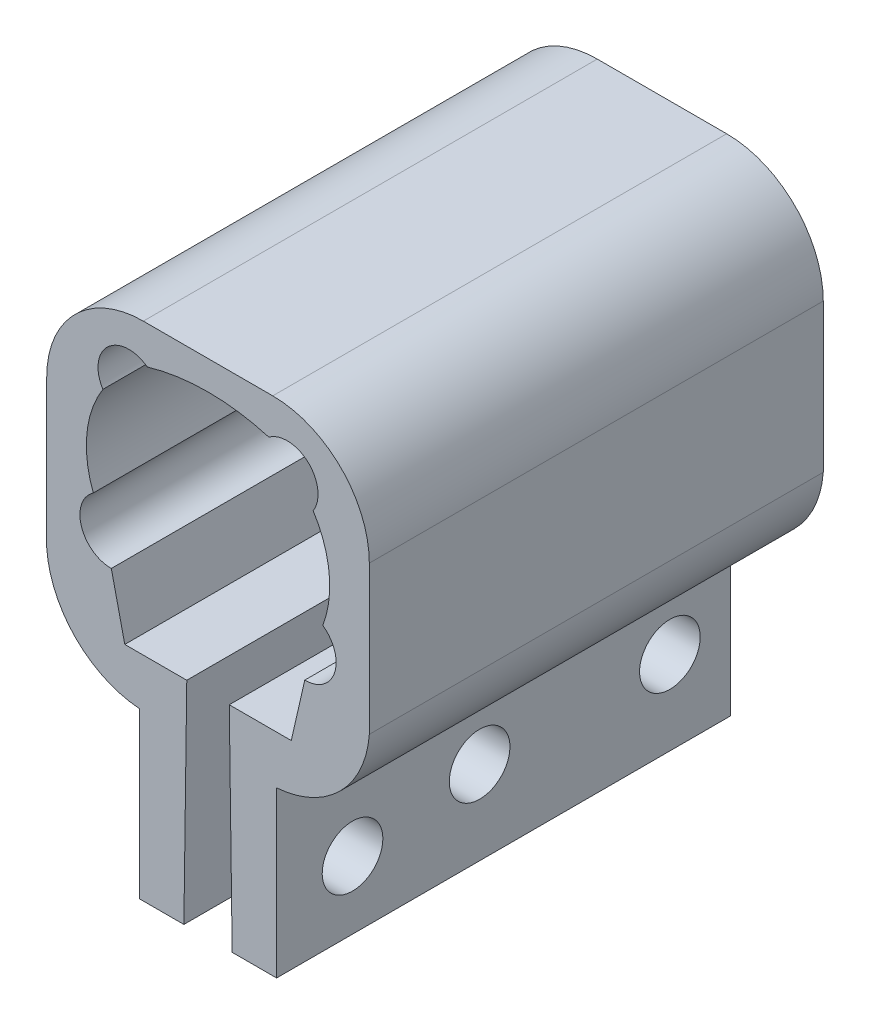
ISO-10303-21;
HEADER;
FILE_DESCRIPTION(('STEP AP214'),'2;1');
FILE_NAME('part.step','',(''),(''),'','','');
FILE_SCHEMA(('AUTOMOTIVE_DESIGN { 1 0 10303 214 1 1 1 1 }'));
ENDSEC;
DATA;
#1=APPLICATION_CONTEXT('core data for automotive mechanical design processes');
#2=APPLICATION_PROTOCOL_DEFINITION('international standard','automotive_design',2000,#1);
#3=PRODUCT_CONTEXT('',#1,'mechanical');
#4=PRODUCT('Part','Part','',(#3));
#5=PRODUCT_RELATED_PRODUCT_CATEGORY('part','',(#4));
#6=PRODUCT_DEFINITION_FORMATION('','',#4);
#7=PRODUCT_DEFINITION_CONTEXT('part definition',#1,'design');
#8=PRODUCT_DEFINITION('design','',#6,#7);
#9=PRODUCT_DEFINITION_SHAPE('','',#8);
#10=(LENGTH_UNIT() NAMED_UNIT(*) SI_UNIT(.MILLI.,.METRE.));
#11=(NAMED_UNIT(*) PLANE_ANGLE_UNIT() SI_UNIT($,.RADIAN.));
#12=(NAMED_UNIT(*) SI_UNIT($,.STERADIAN.) SOLID_ANGLE_UNIT());
#13=UNCERTAINTY_MEASURE_WITH_UNIT(LENGTH_MEASURE(1.E-05),#10,'distance_accuracy_value','');
#14=(GEOMETRIC_REPRESENTATION_CONTEXT(3) GLOBAL_UNCERTAINTY_ASSIGNED_CONTEXT((#13)) GLOBAL_UNIT_ASSIGNED_CONTEXT((#10,
#11,#12)) REPRESENTATION_CONTEXT('',''));
#15=CARTESIAN_POINT('',(0.,0.,0.));
#16=DIRECTION('',(0.,0.,1.));
#17=DIRECTION('',(1.,0.,0.));
#18=AXIS2_PLACEMENT_3D('',#15,#16,#17);
#19=CARTESIAN_POINT('',(0.351294663506426,-12.1939620514924,-103.886));
#20=DIRECTION('',(0.,0.,1.));
#21=DIRECTION('',(1.,0.,0.));
#22=AXIS2_PLACEMENT_3D('',#19,#20,#21);
#23=CYLINDRICAL_SURFACE('',#22,13.1903336531534);
#24=CARTESIAN_POINT('',(0.351294663506426,-12.1939620514924,-44.196));
#25=DIRECTION('',(0.,0.,-1.));
#26=DIRECTION('',(1.,0.,0.));
#27=AXIS2_PLACEMENT_3D('',#24,#25,#26);
#28=CIRCLE('',#27,13.1903336531534);
#29=CARTESIAN_POINT('',(-0.611829569764663,-25.3490862847635,-44.196));
#30=VERTEX_POINT('',#29);
#31=CARTESIAN_POINT('',(-12.8038295697647,-13.1570862847636,-44.196));
#32=VERTEX_POINT('',#31);
#33=EDGE_CURVE('E238',#30,#32,#28,.T.);
#34=ORIENTED_EDGE('',*,*,#33,.T.);
#35=DIRECTION('',(0.,0.,1.));
#36=VECTOR('',#35,1.);
#37=CARTESIAN_POINT('',(-12.8038295697647,-13.1570862847636,-103.886));
#38=LINE('',#37,#36);
#39=CARTESIAN_POINT('',(-12.8038295697647,-13.1570862847636,-103.886));
#40=VERTEX_POINT('',#39);
#41=EDGE_CURVE('E11',#40,#32,#38,.T.);
#42=ORIENTED_EDGE('',*,*,#41,.F.);
#43=CARTESIAN_POINT('',(0.351294663506426,-12.1939620514924,-103.886));
#44=DIRECTION('',(0.,0.,-1.));
#45=DIRECTION('',(1.,0.,0.));
#46=AXIS2_PLACEMENT_3D('',#43,#44,#45);
#47=CIRCLE('',#46,13.1903336531534);
#48=CARTESIAN_POINT('',(-0.611829569764663,-25.3490862847635,-103.886));
#49=VERTEX_POINT('',#48);
#50=EDGE_CURVE('E310',#49,#40,#47,.T.);
#51=ORIENTED_EDGE('',*,*,#50,.F.);
#52=DIRECTION('',(0.,0.,1.));
#53=VECTOR('',#52,1.);
#54=CARTESIAN_POINT('',(-0.611829569764663,-25.3490862847635,-103.886));
#55=LINE('',#54,#53);
#56=EDGE_CURVE('E234',#49,#30,#55,.T.);
#57=ORIENTED_EDGE('',*,*,#56,.T.);
#58=EDGE_LOOP('',(#34,#42,#51,#57));
#59=FACE_BOUND('',#58,.T.);
#60=ADVANCED_FACE('F36',(#59),#23,.T.);
#61=CARTESIAN_POINT('',(-12.8038295697647,-13.1570862847636,-103.886));
#62=DIRECTION('',(1.,0.,0.));
#63=DIRECTION('',(0.,1.,0.));
#64=AXIS2_PLACEMENT_3D('',#61,#62,#63);
#65=PLANE('',#64);
#66=DIRECTION('',(0.,1.,0.));
#67=VECTOR('',#66,1.);
#68=CARTESIAN_POINT('',(-12.8038295697647,-13.1570862847636,-44.196));
#69=LINE('',#68,#67);
#70=CARTESIAN_POINT('',(-12.8038295697647,6.33605057981404,-44.196));
#71=VERTEX_POINT('',#70);
#72=EDGE_CURVE('E242',#32,#71,#69,.T.);
#73=ORIENTED_EDGE('',*,*,#72,.T.);
#74=DIRECTION('',(0.,0.,1.));
#75=VECTOR('',#74,1.);
#76=CARTESIAN_POINT('',(-12.8038295697647,6.33605057981404,-103.886));
#77=LINE('',#76,#75);
#78=CARTESIAN_POINT('',(-12.8038295697647,6.33605057981404,-103.886));
#79=VERTEX_POINT('',#78);
#80=EDGE_CURVE('E46',#79,#71,#77,.T.);
#81=ORIENTED_EDGE('',*,*,#80,.F.);
#82=DIRECTION('',(0.,1.,0.));
#83=VECTOR('',#82,1.);
#84=CARTESIAN_POINT('',(-12.8038295697647,-13.1570862847636,-103.886));
#85=LINE('',#84,#83);
#86=EDGE_CURVE('E144',#40,#79,#85,.T.);
#87=ORIENTED_EDGE('',*,*,#86,.F.);
#88=ORIENTED_EDGE('',*,*,#41,.T.);
#89=EDGE_LOOP('',(#73,#81,#87,#88));
#90=FACE_BOUND('',#89,.T.);
#91=ADVANCED_FACE('F553',(#90),#65,.F.);
#92=CARTESIAN_POINT('',(-0.103829569764661,6.33605057981413,-103.886));
#93=DIRECTION('',(0.,0.,1.));
#94=DIRECTION('',(1.,0.,0.));
#95=AXIS2_PLACEMENT_3D('',#92,#93,#94);
#96=CYLINDRICAL_SURFACE('',#95,12.7);
#97=CARTESIAN_POINT('',(-0.103829569764661,6.33605057981413,-44.196));
#98=DIRECTION('',(0.,0.,-1.));
#99=DIRECTION('',(1.,0.,0.));
#100=AXIS2_PLACEMENT_3D('',#97,#98,#99);
#101=CIRCLE('',#100,12.7);
#102=CARTESIAN_POINT('',(-0.103829569764575,19.0360505798141,-44.196));
#103=VERTEX_POINT('',#102);
#104=EDGE_CURVE('E246',#71,#103,#101,.T.);
#105=ORIENTED_EDGE('',*,*,#104,.T.);
#106=DIRECTION('',(0.,0.,1.));
#107=VECTOR('',#106,1.);
#108=CARTESIAN_POINT('',(-0.103829569764575,19.0360505798141,-103.886));
#109=LINE('',#108,#107);
#110=CARTESIAN_POINT('',(-0.103829569764575,19.0360505798141,-103.886));
#111=VERTEX_POINT('',#110);
#112=EDGE_CURVE('E384',#111,#103,#109,.T.);
#113=ORIENTED_EDGE('',*,*,#112,.F.);
#114=CARTESIAN_POINT('',(-0.103829569764661,6.33605057981413,-103.886));
#115=DIRECTION('',(0.,0.,-1.));
#116=DIRECTION('',(1.,0.,0.));
#117=AXIS2_PLACEMENT_3D('',#114,#115,#116);
#118=CIRCLE('',#117,12.7);
#119=EDGE_CURVE('E432',#79,#111,#118,.T.);
#120=ORIENTED_EDGE('',*,*,#119,.F.);
#121=ORIENTED_EDGE('',*,*,#80,.T.);
#122=EDGE_LOOP('',(#105,#113,#120,#121));
#123=FACE_BOUND('',#122,.T.);
#124=ADVANCED_FACE('F551',(#123),#96,.T.);
#125=CARTESIAN_POINT('',(-0.103829569764574,19.0360505798141,-103.886));
#126=DIRECTION('',(0.,-1.,0.));
#127=DIRECTION('',(1.,0.,0.));
#128=AXIS2_PLACEMENT_3D('',#125,#126,#127);
#129=PLANE('',#128);
#130=DIRECTION('',(1.,0.,0.));
#131=VECTOR('',#130,1.);
#132=CARTESIAN_POINT('',(-0.103829569764574,19.0360505798141,-44.196));
#133=LINE('',#132,#131);
#134=CARTESIAN_POINT('',(16.9141704302352,19.0360505798141,-44.196));
#135=VERTEX_POINT('',#134);
#136=EDGE_CURVE('E249',#103,#135,#133,.T.);
#137=ORIENTED_EDGE('',*,*,#136,.T.);
#138=DIRECTION('',(0.,0.,1.));
#139=VECTOR('',#138,1.);
#140=CARTESIAN_POINT('',(16.9141704302352,19.0360505798141,-103.886));
#141=LINE('',#140,#139);
#142=CARTESIAN_POINT('',(16.9141704302352,19.0360505798141,-103.886));
#143=VERTEX_POINT('',#142);
#144=EDGE_CURVE('E380',#143,#135,#141,.T.);
#145=ORIENTED_EDGE('',*,*,#144,.F.);
#146=DIRECTION('',(1.,0.,0.));
#147=VECTOR('',#146,1.);
#148=CARTESIAN_POINT('',(-0.103829569764574,19.0360505798141,-103.886));
#149=LINE('',#148,#147);
#150=EDGE_CURVE('E434',#111,#143,#149,.T.);
#151=ORIENTED_EDGE('',*,*,#150,.F.);
#152=ORIENTED_EDGE('',*,*,#112,.T.);
#153=EDGE_LOOP('',(#137,#145,#151,#152));
#154=FACE_BOUND('',#153,.T.);
#155=ADVANCED_FACE('F547',(#154),#129,.F.);
#156=CARTESIAN_POINT('',(16.9141704302353,6.33605057981414,-103.886));
#157=DIRECTION('',(0.,0.,1.));
#158=DIRECTION('',(1.,0.,0.));
#159=AXIS2_PLACEMENT_3D('',#156,#157,#158);
#160=CYLINDRICAL_SURFACE('',#159,12.7);
#161=CARTESIAN_POINT('',(16.9141704302353,6.33605057981414,-44.196));
#162=DIRECTION('',(0.,0.,-1.));
#163=DIRECTION('',(1.,0.,0.));
#164=AXIS2_PLACEMENT_3D('',#161,#162,#163);
#165=CIRCLE('',#164,12.7);
#166=CARTESIAN_POINT('',(29.6141704302353,6.33605057981404,-44.196));
#167=VERTEX_POINT('',#166);
#168=EDGE_CURVE('E252',#135,#167,#165,.T.);
#169=ORIENTED_EDGE('',*,*,#168,.T.);
#170=DIRECTION('',(0.,0.,1.));
#171=VECTOR('',#170,1.);
#172=CARTESIAN_POINT('',(29.6141704302353,6.33605057981404,-103.886));
#173=LINE('',#172,#171);
#174=CARTESIAN_POINT('',(29.6141704302353,6.33605057981404,-103.886));
#175=VERTEX_POINT('',#174);
#176=EDGE_CURVE('E376',#175,#167,#173,.T.);
#177=ORIENTED_EDGE('',*,*,#176,.F.);
#178=CARTESIAN_POINT('',(16.9141704302353,6.33605057981414,-103.886));
#179=DIRECTION('',(0.,0.,-1.));
#180=DIRECTION('',(1.,0.,0.));
#181=AXIS2_PLACEMENT_3D('',#178,#179,#180);
#182=CIRCLE('',#181,12.7);
#183=EDGE_CURVE('E437',#143,#175,#182,.T.);
#184=ORIENTED_EDGE('',*,*,#183,.F.);
#185=ORIENTED_EDGE('',*,*,#144,.T.);
#186=EDGE_LOOP('',(#169,#177,#184,#185));
#187=FACE_BOUND('',#186,.T.);
#188=ADVANCED_FACE('F543',(#187),#160,.T.);
#189=CARTESIAN_POINT('',(29.6141704302353,6.33605057981404,-103.886));
#190=DIRECTION('',(-1.,0.,0.));
#191=DIRECTION('',(0.,-1.,0.));
#192=AXIS2_PLACEMENT_3D('',#189,#190,#191);
#193=PLANE('',#192);
#194=DIRECTION('',(0.,-1.,0.));
#195=VECTOR('',#194,1.);
#196=CARTESIAN_POINT('',(29.6141704302353,6.33605057981404,-44.196));
#197=LINE('',#196,#195);
#198=CARTESIAN_POINT('',(29.6141704302353,-13.1570862847636,-44.196));
#199=VERTEX_POINT('',#198);
#200=EDGE_CURVE('E255',#167,#199,#197,.T.);
#201=ORIENTED_EDGE('',*,*,#200,.T.);
#202=DIRECTION('',(0.,0.,1.));
#203=VECTOR('',#202,1.);
#204=CARTESIAN_POINT('',(29.6141704302353,-13.1570862847636,-103.886));
#205=LINE('',#204,#203);
#206=CARTESIAN_POINT('',(29.6141704302353,-13.1570862847636,-103.886));
#207=VERTEX_POINT('',#206);
#208=EDGE_CURVE('E372',#207,#199,#205,.T.);
#209=ORIENTED_EDGE('',*,*,#208,.F.);
#210=DIRECTION('',(0.,-1.,0.));
#211=VECTOR('',#210,1.);
#212=CARTESIAN_POINT('',(29.6141704302353,6.33605057981404,-103.886));
#213=LINE('',#212,#211);
#214=EDGE_CURVE('E440',#175,#207,#213,.T.);
#215=ORIENTED_EDGE('',*,*,#214,.F.);
#216=ORIENTED_EDGE('',*,*,#176,.T.);
#217=EDGE_LOOP('',(#201,#209,#215,#216));
#218=FACE_BOUND('',#217,.T.);
#219=ADVANCED_FACE('F539',(#218),#193,.F.);
#220=CARTESIAN_POINT('',(16.4590461969643,-12.1939620514924,-103.886));
#221=DIRECTION('',(0.,0.,1.));
#222=DIRECTION('',(1.,0.,0.));
#223=AXIS2_PLACEMENT_3D('',#220,#221,#222);
#224=CYLINDRICAL_SURFACE('',#223,13.1903336531534);
#225=CARTESIAN_POINT('',(16.4590461969643,-12.1939620514924,-44.196));
#226=DIRECTION('',(0.,0.,-1.));
#227=DIRECTION('',(-1.,0.,0.));
#228=AXIS2_PLACEMENT_3D('',#225,#226,#227);
#229=CIRCLE('',#228,13.1903336531534);
#230=CARTESIAN_POINT('',(17.4221704302353,-25.3490862847635,-44.196));
#231=VERTEX_POINT('',#230);
#232=EDGE_CURVE('E258',#199,#231,#229,.T.);
#233=ORIENTED_EDGE('',*,*,#232,.T.);
#234=DIRECTION('',(0.,0.,1.));
#235=VECTOR('',#234,1.);
#236=CARTESIAN_POINT('',(17.4221704302353,-25.3490862847635,-103.886));
#237=LINE('',#236,#235);
#238=CARTESIAN_POINT('',(17.4221704302353,-25.3490862847635,-103.886));
#239=VERTEX_POINT('',#238);
#240=EDGE_CURVE('E368',#239,#231,#237,.T.);
#241=ORIENTED_EDGE('',*,*,#240,.F.);
#242=CARTESIAN_POINT('',(16.4590461969643,-12.1939620514924,-103.886));
#243=DIRECTION('',(0.,0.,-1.));
#244=DIRECTION('',(-1.,0.,0.));
#245=AXIS2_PLACEMENT_3D('',#242,#243,#244);
#246=CIRCLE('',#245,13.1903336531534);
#247=EDGE_CURVE('E443',#207,#239,#246,.T.);
#248=ORIENTED_EDGE('',*,*,#247,.F.);
#249=ORIENTED_EDGE('',*,*,#208,.T.);
#250=EDGE_LOOP('',(#233,#241,#248,#249));
#251=FACE_BOUND('',#250,.T.);
#252=ADVANCED_FACE('F506',(#251),#224,.T.);
#253=CARTESIAN_POINT('',(17.4221704302353,-47.0039494201859,-103.886));
#254=DIRECTION('',(-1.,0.,0.));
#255=DIRECTION('',(0.,-1.,0.));
#256=AXIS2_PLACEMENT_3D('',#253,#254,#255);
#257=PLANE('',#256);
#258=CARTESIAN_POINT('',(17.4221704302353,-36.0057494201859,-95.9104));
#259=DIRECTION('',(1.,0.,0.));
#260=DIRECTION('',(0.,1.,0.));
#261=AXIS2_PLACEMENT_3D('',#258,#259,#260);
#262=CIRCLE('',#261,3.98780000000001);
#263=CARTESIAN_POINT('',(17.4221704302353,-32.0179494201859,-95.9104));
#264=VERTEX_POINT('',#263);
#265=EDGE_CURVE('E395',#264,#264,#262,.T.);
#266=ORIENTED_EDGE('',*,*,#265,.F.);
#267=EDGE_LOOP('',(#266));
#268=FACE_BOUND('',#267,.T.);
#269=CARTESIAN_POINT('',(17.4221704302353,-36.0057494201859,-70.8914));
#270=DIRECTION('',(1.,0.,0.));
#271=DIRECTION('',(0.,1.,0.));
#272=AXIS2_PLACEMENT_3D('',#269,#270,#271);
#273=CIRCLE('',#272,3.98780000000001);
#274=CARTESIAN_POINT('',(17.4221704302353,-32.0179494201859,-70.8914));
#275=VERTEX_POINT('',#274);
#276=EDGE_CURVE('E486',#275,#275,#273,.T.);
#277=ORIENTED_EDGE('',*,*,#276,.F.);
#278=EDGE_LOOP('',(#277));
#279=FACE_BOUND('',#278,.T.);
#280=CARTESIAN_POINT('',(17.4221704302353,-38.1139494201859,-54.1782));
#281=DIRECTION('',(1.,0.,0.));
#282=DIRECTION('',(0.,1.,0.));
#283=AXIS2_PLACEMENT_3D('',#280,#281,#282);
#284=CIRCLE('',#283,3.9878);
#285=CARTESIAN_POINT('',(17.4221704302353,-34.1261494201859,-54.1782));
#286=VERTEX_POINT('',#285);
#287=EDGE_CURVE('E488',#286,#286,#284,.T.);
#288=ORIENTED_EDGE('',*,*,#287,.F.);
#289=EDGE_LOOP('',(#288));
#290=FACE_BOUND('',#289,.T.);
#291=DIRECTION('',(0.,-1.,0.));
#292=VECTOR('',#291,1.);
#293=CARTESIAN_POINT('',(17.4221704302353,-47.0039494201859,-44.196));
#294=LINE('',#293,#292);
#295=CARTESIAN_POINT('',(17.4221704302353,-47.0039494201859,-44.196));
#296=VERTEX_POINT('',#295);
#297=EDGE_CURVE('E261',#231,#296,#294,.T.);
#298=ORIENTED_EDGE('',*,*,#297,.T.);
#299=DIRECTION('',(0.,0.,1.));
#300=VECTOR('',#299,1.);
#301=CARTESIAN_POINT('',(17.4221704302353,-47.0039494201859,-103.886));
#302=LINE('',#301,#300);
#303=CARTESIAN_POINT('',(17.4221704302353,-47.0039494201859,-103.886));
#304=VERTEX_POINT('',#303);
#305=EDGE_CURVE('E364',#304,#296,#302,.T.);
#306=ORIENTED_EDGE('',*,*,#305,.F.);
#307=DIRECTION('',(0.,-1.,0.));
#308=VECTOR('',#307,1.);
#309=CARTESIAN_POINT('',(17.4221704302353,-26.6839494201859,-103.886));
#310=LINE('',#309,#308);
#311=EDGE_CURVE('E446',#239,#304,#310,.T.);
#312=ORIENTED_EDGE('',*,*,#311,.F.);
#313=ORIENTED_EDGE('',*,*,#240,.T.);
#314=EDGE_LOOP('',(#298,#306,#312,#313));
#315=FACE_BOUND('',#314,.T.);
#316=ADVANCED_FACE('F502',(#268,#279,#290,#315),#257,.F.);
#317=CARTESIAN_POINT('',(11.5801704302353,-47.0039494201859,-103.886));
#318=DIRECTION('',(0.,1.,0.));
#319=DIRECTION('',(0.,0.,1.));
#320=AXIS2_PLACEMENT_3D('',#317,#318,#319);
#321=PLANE('',#320);
#322=DIRECTION('',(-1.,0.,0.));
#323=VECTOR('',#322,1.);
#324=CARTESIAN_POINT('',(11.5801704302353,-47.0039494201859,-44.196));
#325=LINE('',#324,#323);
#326=CARTESIAN_POINT('',(11.5801704302353,-47.0039494201859,-44.196));
#327=VERTEX_POINT('',#326);
#328=EDGE_CURVE('E264',#296,#327,#325,.T.);
#329=ORIENTED_EDGE('',*,*,#328,.T.);
#330=DIRECTION('',(0.,0.,1.));
#331=VECTOR('',#330,1.);
#332=CARTESIAN_POINT('',(11.5801704302353,-47.0039494201859,-103.886));
#333=LINE('',#332,#331);
#334=CARTESIAN_POINT('',(11.5801704302353,-47.0039494201859,-103.886));
#335=VERTEX_POINT('',#334);
#336=EDGE_CURVE('E360',#335,#327,#333,.T.);
#337=ORIENTED_EDGE('',*,*,#336,.F.);
#338=DIRECTION('',(-1.,0.,0.));
#339=VECTOR('',#338,1.);
#340=CARTESIAN_POINT('',(11.5801704302353,-47.0039494201859,-103.886));
#341=LINE('',#340,#339);
#342=EDGE_CURVE('E449',#304,#335,#341,.T.);
#343=ORIENTED_EDGE('',*,*,#342,.F.);
#344=ORIENTED_EDGE('',*,*,#305,.T.);
#345=EDGE_LOOP('',(#329,#337,#343,#344));
#346=FACE_BOUND('',#345,.T.);
#347=ADVANCED_FACE('F505',(#346),#321,.F.);
#348=CARTESIAN_POINT('',(11.5801704302353,-47.0039494201859,-103.886));
#349=DIRECTION('',(0.999907467826382,0.013603521052741,0.));
#350=DIRECTION('',(-0.013603521052741,0.999907467826382,0.));
#351=AXIS2_PLACEMENT_3D('',#348,#349,#350);
#352=PLANE('',#351);
#353=CARTESIAN_POINT('',(11.4305423395806,-36.0057494201859,-95.9104));
#354=DIRECTION('',(0.999907467826382,0.013603521052741,0.));
#355=DIRECTION('',(0.013603521052741,-0.999907467826382,0.));
#356=AXIS2_PLACEMENT_3D('',#353,#354,#355);
#357=ELLIPSE('',#356,3.98816903394947,3.98780000000001);
#358=CARTESIAN_POINT('',(11.4847954809958,-39.9935494201859,-95.9104));
#359=VERTEX_POINT('',#358);
#360=EDGE_CURVE('E243',#359,#359,#357,.T.);
#361=ORIENTED_EDGE('',*,*,#360,.T.);
#362=EDGE_LOOP('',(#361));
#363=FACE_BOUND('',#362,.T.);
#364=CARTESIAN_POINT('',(11.4305423395806,-36.0057494201859,-70.8914));
#365=DIRECTION('',(0.999907467826382,0.013603521052741,0.));
#366=DIRECTION('',(0.013603521052741,-0.999907467826382,0.));
#367=AXIS2_PLACEMENT_3D('',#364,#365,#366);
#368=ELLIPSE('',#367,3.98816903394947,3.98780000000001);
#369=CARTESIAN_POINT('',(11.4847954809958,-39.9935494201859,-70.8914));
#370=VERTEX_POINT('',#369);
#371=EDGE_CURVE('E406',#370,#370,#368,.T.);
#372=ORIENTED_EDGE('',*,*,#371,.T.);
#373=EDGE_LOOP('',(#372));
#374=FACE_BOUND('',#373,.T.);
#375=CARTESIAN_POINT('',(11.4592239366345,-38.1139494201859,-54.1782));
#376=DIRECTION('',(0.999907467826382,0.013603521052741,0.));
#377=DIRECTION('',(0.013603521052741,-0.999907467826382,0.));
#378=AXIS2_PLACEMENT_3D('',#375,#376,#377);
#379=ELLIPSE('',#378,3.98816903394947,3.9878);
#380=CARTESIAN_POINT('',(11.5134770780497,-42.1017494201859,-54.1782));
#381=VERTEX_POINT('',#380);
#382=EDGE_CURVE('E400',#381,#381,#379,.T.);
#383=ORIENTED_EDGE('',*,*,#382,.T.);
#384=EDGE_LOOP('',(#383));
#385=FACE_BOUND('',#384,.T.);
#386=DIRECTION('',(-0.013603521052741,0.999907467826382,0.));
#387=VECTOR('',#386,1.);
#388=CARTESIAN_POINT('',(11.5801704302353,-47.0039494201859,-44.196));
#389=LINE('',#388,#387);
#390=CARTESIAN_POINT('',(11.1991704302353,-18.9990862847635,-44.196));
#391=VERTEX_POINT('',#390);
#392=EDGE_CURVE('E267',#327,#391,#389,.T.);
#393=ORIENTED_EDGE('',*,*,#392,.T.);
#394=DIRECTION('',(0.,0.,1.));
#395=VECTOR('',#394,1.);
#396=CARTESIAN_POINT('',(11.1991704302353,-18.9990862847635,-103.886));
#397=LINE('',#396,#395);
#398=CARTESIAN_POINT('',(11.1991704302353,-18.9990862847635,-103.886));
#399=VERTEX_POINT('',#398);
#400=EDGE_CURVE('E356',#399,#391,#397,.T.);
#401=ORIENTED_EDGE('',*,*,#400,.F.);
#402=DIRECTION('',(-0.013603521052741,0.999907467826382,0.));
#403=VECTOR('',#402,1.);
#404=CARTESIAN_POINT('',(11.5801704302353,-47.0039494201859,-103.886));
#405=LINE('',#404,#403);
#406=EDGE_CURVE('E452',#335,#399,#405,.T.);
#407=ORIENTED_EDGE('',*,*,#406,.F.);
#408=ORIENTED_EDGE('',*,*,#336,.T.);
#409=EDGE_LOOP('',(#393,#401,#407,#408));
#410=FACE_BOUND('',#409,.T.);
#411=ADVANCED_FACE('F523',(#363,#374,#385,#410),#352,.F.);
#412=CARTESIAN_POINT('',(11.1991704302353,-18.9990862847635,-103.886));
#413=DIRECTION('',(0.,-1.,0.));
#414=DIRECTION('',(0.,0.,-1.));
#415=AXIS2_PLACEMENT_3D('',#412,#413,#414);
#416=PLANE('',#415);
#417=DIRECTION('',(1.,0.,0.));
#418=VECTOR('',#417,1.);
#419=CARTESIAN_POINT('',(11.1991704302353,-18.9990862847635,-44.196));
#420=LINE('',#419,#418);
#421=CARTESIAN_POINT('',(19.3513779407278,-18.9990862847635,-44.196));
#422=VERTEX_POINT('',#421);
#423=EDGE_CURVE('E270',#391,#422,#420,.T.);
#424=ORIENTED_EDGE('',*,*,#423,.T.);
#425=DIRECTION('',(0.,0.,1.));
#426=VECTOR('',#425,1.);
#427=CARTESIAN_POINT('',(19.3513779407278,-18.9990862847635,-103.886));
#428=LINE('',#427,#426);
#429=CARTESIAN_POINT('',(19.3513779407278,-18.9990862847635,-103.886));
#430=VERTEX_POINT('',#429);
#431=EDGE_CURVE('E352',#430,#422,#428,.T.);
#432=ORIENTED_EDGE('',*,*,#431,.F.);
#433=DIRECTION('',(1.,0.,0.));
#434=VECTOR('',#433,1.);
#435=CARTESIAN_POINT('',(11.1991704302353,-18.9990862847635,-103.886));
#436=LINE('',#435,#434);
#437=EDGE_CURVE('E455',#399,#430,#436,.T.);
#438=ORIENTED_EDGE('',*,*,#437,.F.);
#439=ORIENTED_EDGE('',*,*,#400,.T.);
#440=EDGE_LOOP('',(#424,#432,#438,#439));
#441=FACE_BOUND('',#440,.T.);
#442=ADVANCED_FACE('F527',(#441),#416,.F.);
#443=CARTESIAN_POINT('',(21.1226398060632,-11.2308378182214,-103.886));
#444=DIRECTION('',(0.974976630980173,-0.22230737514206,0.));
#445=DIRECTION('',(0.22230737514206,0.974976630980173,0.));
#446=AXIS2_PLACEMENT_3D('',#443,#444,#445);
#447=PLANE('',#446);
#448=DIRECTION('',(0.22230737514206,0.974976630980173,0.));
#449=VECTOR('',#448,1.);
#450=CARTESIAN_POINT('',(21.1226398060632,-11.2308378182214,-44.196));
#451=LINE('',#450,#449);
#452=CARTESIAN_POINT('',(21.1226398060632,-11.2308378182214,-44.196));
#453=VERTEX_POINT('',#452);
#454=EDGE_CURVE('E273',#422,#453,#451,.T.);
#455=ORIENTED_EDGE('',*,*,#454,.T.);
#456=DIRECTION('',(0.,0.,1.));
#457=VECTOR('',#456,1.);
#458=CARTESIAN_POINT('',(21.1226398060632,-11.2308378182214,-103.886));
#459=LINE('',#458,#457);
#460=CARTESIAN_POINT('',(21.1226398060632,-11.2308378182214,-103.886));
#461=VERTEX_POINT('',#460);
#462=EDGE_CURVE('E348',#461,#453,#459,.T.);
#463=ORIENTED_EDGE('',*,*,#462,.F.);
#464=DIRECTION('',(0.22230737514206,0.974976630980173,0.));
#465=VECTOR('',#464,1.);
#466=CARTESIAN_POINT('',(21.1226398060632,-11.2308378182214,-103.886));
#467=LINE('',#466,#465);
#468=EDGE_CURVE('E458',#430,#461,#467,.T.);
#469=ORIENTED_EDGE('',*,*,#468,.F.);
#470=ORIENTED_EDGE('',*,*,#431,.T.);
#471=EDGE_LOOP('',(#455,#463,#469,#470));
#472=FACE_BOUND('',#471,.T.);
#473=ADVANCED_FACE('F593',(#472),#447,.F.);
#474=CARTESIAN_POINT('',(21.1853782567581,-7.16732211297246,-103.886));
#475=DIRECTION('',(0.,0.,1.));
#476=DIRECTION('',(1.,0.,0.));
#477=AXIS2_PLACEMENT_3D('',#474,#475,#476);
#478=CYLINDRICAL_SURFACE('',#477,4.064);
#479=CARTESIAN_POINT('',(21.1853782567581,-7.16732211297246,-44.196));
#480=DIRECTION('',(0.,0.,1.));
#481=DIRECTION('',(1.,0.,0.));
#482=AXIS2_PLACEMENT_3D('',#479,#480,#481);
#483=CIRCLE('',#482,4.064);
#484=CARTESIAN_POINT('',(23.4896364517059,-3.81971249250951,-44.196));
#485=VERTEX_POINT('',#484);
#486=EDGE_CURVE('E276',#453,#485,#483,.T.);
#487=ORIENTED_EDGE('',*,*,#486,.T.);
#488=DIRECTION('',(0.,0.,1.));
#489=VECTOR('',#488,1.);
#490=CARTESIAN_POINT('',(23.4896364517059,-3.81971249250951,-103.886));
#491=LINE('',#490,#489);
#492=CARTESIAN_POINT('',(23.4896364517059,-3.81971249250951,-103.886));
#493=VERTEX_POINT('',#492);
#494=EDGE_CURVE('E344',#493,#485,#491,.T.);
#495=ORIENTED_EDGE('',*,*,#494,.F.);
#496=CARTESIAN_POINT('',(21.1853782567581,-7.16732211297246,-103.886));
#497=DIRECTION('',(0.,0.,1.));
#498=DIRECTION('',(1.,0.,0.));
#499=AXIS2_PLACEMENT_3D('',#496,#497,#498);
#500=CIRCLE('',#499,4.064);
#501=EDGE_CURVE('E461',#461,#493,#500,.T.);
#502=ORIENTED_EDGE('',*,*,#501,.F.);
#503=ORIENTED_EDGE('',*,*,#462,.T.);
#504=EDGE_LOOP('',(#487,#495,#502,#503));
#505=FACE_BOUND('',#504,.T.);
#506=ADVANCED_FACE('F596',(#505),#478,.F.);
#507=CARTESIAN_POINT('',(10.5213998340133,1.14410298335588,-103.886));
#508=DIRECTION('',(0.,0.,1.));
#509=DIRECTION('',(1.,0.,0.));
#510=AXIS2_PLACEMENT_3D('',#507,#508,#509);
#511=CYLINDRICAL_SURFACE('',#510,13.885770596222);
#512=CARTESIAN_POINT('',(10.5213998340133,1.14410298335588,-44.196));
#513=DIRECTION('',(0.,0.,1.));
#514=DIRECTION('',(1.,0.,0.));
#515=AXIS2_PLACEMENT_3D('',#512,#513,#514);
#516=CIRCLE('',#515,13.885770596222);
#517=CARTESIAN_POINT('',(22.2277123878138,8.61249447307007,-44.196));
#518=VERTEX_POINT('',#517);
#519=EDGE_CURVE('E279',#485,#518,#516,.T.);
#520=ORIENTED_EDGE('',*,*,#519,.T.);
#521=DIRECTION('',(0.,0.,1.));
#522=VECTOR('',#521,1.);
#523=CARTESIAN_POINT('',(22.2277123878138,8.61249447307007,-103.886));
#524=LINE('',#523,#522);
#525=CARTESIAN_POINT('',(22.2277123878138,8.61249447307007,-103.886));
#526=VERTEX_POINT('',#525);
#527=EDGE_CURVE('E340',#526,#518,#524,.T.);
#528=ORIENTED_EDGE('',*,*,#527,.F.);
#529=CARTESIAN_POINT('',(10.5213998340133,1.14410298335588,-103.886));
#530=DIRECTION('',(0.,0.,1.));
#531=DIRECTION('',(1.,0.,0.));
#532=AXIS2_PLACEMENT_3D('',#529,#530,#531);
#533=CIRCLE('',#532,13.885770596222);
#534=EDGE_CURVE('E464',#493,#526,#533,.T.);
#535=ORIENTED_EDGE('',*,*,#534,.F.);
#536=ORIENTED_EDGE('',*,*,#494,.T.);
#537=EDGE_LOOP('',(#520,#528,#535,#536));
#538=FACE_BOUND('',#537,.T.);
#539=ADVANCED_FACE('F600',(#538),#511,.F.);
#540=CARTESIAN_POINT('',(18.8092813069345,10.8103172469255,-103.886));
#541=DIRECTION('',(0.,0.,1.));
#542=DIRECTION('',(1.,0.,0.));
#543=AXIS2_PLACEMENT_3D('',#540,#541,#542);
#544=CYLINDRICAL_SURFACE('',#543,4.064);
#545=CARTESIAN_POINT('',(18.8092813069345,10.8103172469255,-44.196));
#546=DIRECTION('',(0.,0.,1.));
#547=DIRECTION('',(1.,0.,0.));
#548=AXIS2_PLACEMENT_3D('',#545,#546,#547);
#549=CIRCLE('',#548,4.064);
#550=CARTESIAN_POINT('',(16.3944418606768,14.0790549924166,-44.196));
#551=VERTEX_POINT('',#550);
#552=EDGE_CURVE('E282',#518,#551,#549,.T.);
#553=ORIENTED_EDGE('',*,*,#552,.T.);
#554=DIRECTION('',(0.,0.,1.));
#555=VECTOR('',#554,1.);
#556=CARTESIAN_POINT('',(16.3944418606768,14.0790549924166,-103.886));
#557=LINE('',#556,#555);
#558=CARTESIAN_POINT('',(16.3944418606768,14.0790549924166,-103.886));
#559=VERTEX_POINT('',#558);
#560=EDGE_CURVE('E336',#559,#551,#557,.T.);
#561=ORIENTED_EDGE('',*,*,#560,.F.);
#562=CARTESIAN_POINT('',(18.8092813069345,10.8103172469255,-103.886));
#563=DIRECTION('',(0.,0.,1.));
#564=DIRECTION('',(1.,0.,0.));
#565=AXIS2_PLACEMENT_3D('',#562,#563,#564);
#566=CIRCLE('',#565,4.064);
#567=EDGE_CURVE('E467',#526,#559,#566,.T.);
#568=ORIENTED_EDGE('',*,*,#567,.F.);
#569=ORIENTED_EDGE('',*,*,#527,.T.);
#570=EDGE_LOOP('',(#553,#561,#568,#569));
#571=FACE_BOUND('',#570,.T.);
#572=ADVANCED_FACE('F604',(#571),#544,.F.);
#573=CARTESIAN_POINT('',(8.40517043023535,-13.1716423069502,-103.886));
#574=DIRECTION('',(0.,0.,1.));
#575=DIRECTION('',(1.,0.,0.));
#576=AXIS2_PLACEMENT_3D('',#573,#574,#575);
#577=CYLINDRICAL_SURFACE('',#576,28.3976928867644);
#578=CARTESIAN_POINT('',(8.40517043023535,-13.1716423069502,-44.196));
#579=DIRECTION('',(0.,0.,1.));
#580=DIRECTION('',(-1.,0.,0.));
#581=AXIS2_PLACEMENT_3D('',#578,#579,#580);
#582=CIRCLE('',#581,28.3976928867644);
#583=CARTESIAN_POINT('',(0.415898999793881,14.0790549924166,-44.196));
#584=VERTEX_POINT('',#583);
#585=EDGE_CURVE('E285',#551,#584,#582,.T.);
#586=ORIENTED_EDGE('',*,*,#585,.T.);
#587=DIRECTION('',(0.,0.,1.));
#588=VECTOR('',#587,1.);
#589=CARTESIAN_POINT('',(0.415898999793881,14.0790549924166,-103.886));
#590=LINE('',#589,#588);
#591=CARTESIAN_POINT('',(0.415898999793881,14.0790549924166,-103.886));
#592=VERTEX_POINT('',#591);
#593=EDGE_CURVE('E332',#592,#584,#590,.T.);
#594=ORIENTED_EDGE('',*,*,#593,.F.);
#595=CARTESIAN_POINT('',(8.40517043023535,-13.1716423069502,-103.886));
#596=DIRECTION('',(0.,0.,1.));
#597=DIRECTION('',(-1.,0.,0.));
#598=AXIS2_PLACEMENT_3D('',#595,#596,#597);
#599=CIRCLE('',#598,28.3976928867644);
#600=EDGE_CURVE('E470',#559,#592,#599,.T.);
#601=ORIENTED_EDGE('',*,*,#600,.F.);
#602=ORIENTED_EDGE('',*,*,#560,.T.);
#603=EDGE_LOOP('',(#586,#594,#601,#602));
#604=FACE_BOUND('',#603,.T.);
#605=ADVANCED_FACE('F608',(#604),#577,.F.);
#606=CARTESIAN_POINT('',(-1.99894044646379,10.8103172469256,-103.886));
#607=DIRECTION('',(0.,0.,1.));
#608=DIRECTION('',(1.,0.,0.));
#609=AXIS2_PLACEMENT_3D('',#606,#607,#608);
#610=CYLINDRICAL_SURFACE('',#609,4.064);
#611=CARTESIAN_POINT('',(-1.99894044646379,10.8103172469256,-44.196));
#612=DIRECTION('',(0.,0.,1.));
#613=DIRECTION('',(-1.,0.,0.));
#614=AXIS2_PLACEMENT_3D('',#611,#612,#613);
#615=CIRCLE('',#614,4.064);
#616=CARTESIAN_POINT('',(-5.41737210416236,8.61249537023851,-44.196));
#617=VERTEX_POINT('',#616);
#618=EDGE_CURVE('E288',#584,#617,#615,.T.);
#619=ORIENTED_EDGE('',*,*,#618,.T.);
#620=DIRECTION('',(0.,0.,1.));
#621=VECTOR('',#620,1.);
#622=CARTESIAN_POINT('',(-5.41737210416236,8.61249537023851,-103.886));
#623=LINE('',#622,#621);
#624=CARTESIAN_POINT('',(-5.41737210416236,8.61249537023851,-103.886));
#625=VERTEX_POINT('',#624);
#626=EDGE_CURVE('E328',#625,#617,#623,.T.);
#627=ORIENTED_EDGE('',*,*,#626,.F.);
#628=CARTESIAN_POINT('',(-1.99894044646379,10.8103172469256,-103.886));
#629=DIRECTION('',(0.,0.,1.));
#630=DIRECTION('',(-1.,0.,0.));
#631=AXIS2_PLACEMENT_3D('',#628,#629,#630);
#632=CIRCLE('',#631,4.064);
#633=EDGE_CURVE('E473',#592,#625,#632,.T.);
#634=ORIENTED_EDGE('',*,*,#633,.F.);
#635=ORIENTED_EDGE('',*,*,#593,.T.);
#636=EDGE_LOOP('',(#619,#627,#634,#635));
#637=FACE_BOUND('',#636,.T.);
#638=ADVANCED_FACE('F612',(#637),#610,.F.);
#639=CARTESIAN_POINT('',(6.2888591689318,1.14411103891715,-103.886));
#640=DIRECTION('',(0.,0.,1.));
#641=DIRECTION('',(1.,0.,0.));
#642=AXIS2_PLACEMENT_3D('',#639,#640,#641);
#643=CYLINDRICAL_SURFACE('',#642,13.8856982229737);
#644=CARTESIAN_POINT('',(6.2888591689318,1.14411103891715,-44.196));
#645=DIRECTION('',(0.,0.,1.));
#646=DIRECTION('',(-1.,0.,0.));
#647=AXIS2_PLACEMENT_3D('',#644,#645,#646);
#648=CIRCLE('',#647,13.8856982229737);
#649=CARTESIAN_POINT('',(-6.67929660450664,-3.81971318997427,-44.196));
#650=VERTEX_POINT('',#649);
#651=EDGE_CURVE('E291',#617,#650,#648,.T.);
#652=ORIENTED_EDGE('',*,*,#651,.T.);
#653=DIRECTION('',(0.,0.,1.));
#654=VECTOR('',#653,1.);
#655=CARTESIAN_POINT('',(-6.67929660450664,-3.81971318997427,-103.886));
#656=LINE('',#655,#654);
#657=CARTESIAN_POINT('',(-6.67929660450664,-3.81971318997427,-103.886));
#658=VERTEX_POINT('',#657);
#659=EDGE_CURVE('E324',#658,#650,#656,.T.);
#660=ORIENTED_EDGE('',*,*,#659,.F.);
#661=CARTESIAN_POINT('',(6.2888591689318,1.14411103891715,-103.886));
#662=DIRECTION('',(0.,0.,1.));
#663=DIRECTION('',(-1.,0.,0.));
#664=AXIS2_PLACEMENT_3D('',#661,#662,#663);
#665=CIRCLE('',#664,13.8856982229737);
#666=EDGE_CURVE('E476',#625,#658,#665,.T.);
#667=ORIENTED_EDGE('',*,*,#666,.F.);
#668=ORIENTED_EDGE('',*,*,#626,.T.);
#669=EDGE_LOOP('',(#652,#660,#667,#668));
#670=FACE_BOUND('',#669,.T.);
#671=ADVANCED_FACE('F616',(#670),#643,.F.);
#672=CARTESIAN_POINT('',(-4.37503739628746,-7.16732211297246,-103.886));
#673=DIRECTION('',(0.,0.,1.));
#674=DIRECTION('',(1.,0.,0.));
#675=AXIS2_PLACEMENT_3D('',#672,#673,#674);
#676=CYLINDRICAL_SURFACE('',#675,4.064);
#677=CARTESIAN_POINT('',(-4.37503739628746,-7.16732211297246,-44.196));
#678=DIRECTION('',(0.,0.,1.));
#679=DIRECTION('',(-1.,0.,0.));
#680=AXIS2_PLACEMENT_3D('',#677,#678,#679);
#681=CIRCLE('',#680,4.064);
#682=CARTESIAN_POINT('',(-4.3122989455925,-11.2308378182214,-44.196));
#683=VERTEX_POINT('',#682);
#684=EDGE_CURVE('E294',#650,#683,#681,.T.);
#685=ORIENTED_EDGE('',*,*,#684,.T.);
#686=DIRECTION('',(0.,0.,1.));
#687=VECTOR('',#686,1.);
#688=CARTESIAN_POINT('',(-4.3122989455925,-11.2308378182214,-103.886));
#689=LINE('',#688,#687);
#690=CARTESIAN_POINT('',(-4.3122989455925,-11.2308378182214,-103.886));
#691=VERTEX_POINT('',#690);
#692=EDGE_CURVE('E320',#691,#683,#689,.T.);
#693=ORIENTED_EDGE('',*,*,#692,.F.);
#694=CARTESIAN_POINT('',(-4.37503739628746,-7.16732211297246,-103.886));
#695=DIRECTION('',(0.,0.,1.));
#696=DIRECTION('',(-1.,0.,0.));
#697=AXIS2_PLACEMENT_3D('',#694,#695,#696);
#698=CIRCLE('',#697,4.064);
#699=EDGE_CURVE('E479',#658,#691,#698,.T.);
#700=ORIENTED_EDGE('',*,*,#699,.F.);
#701=ORIENTED_EDGE('',*,*,#659,.T.);
#702=EDGE_LOOP('',(#685,#693,#700,#701));
#703=FACE_BOUND('',#702,.T.);
#704=ADVANCED_FACE('F620',(#703),#676,.F.);
#705=CARTESIAN_POINT('',(-2.54103708025715,-18.9990862847635,-103.886));
#706=DIRECTION('',(-0.974976630980173,-0.222307375142059,0.));
#707=DIRECTION('',(0.222307375142059,-0.974976630980173,0.));
#708=AXIS2_PLACEMENT_3D('',#705,#706,#707);
#709=PLANE('',#708);
#710=DIRECTION('',(0.222307375142059,-0.974976630980173,0.));
#711=VECTOR('',#710,1.);
#712=CARTESIAN_POINT('',(-2.54103708025715,-18.9990862847635,-44.196));
#713=LINE('',#712,#711);
#714=CARTESIAN_POINT('',(-2.54103708025715,-18.9990862847635,-44.196));
#715=VERTEX_POINT('',#714);
#716=EDGE_CURVE('E297',#683,#715,#713,.T.);
#717=ORIENTED_EDGE('',*,*,#716,.T.);
#718=DIRECTION('',(0.,0.,1.));
#719=VECTOR('',#718,1.);
#720=CARTESIAN_POINT('',(-2.54103708025715,-18.9990862847635,-103.886));
#721=LINE('',#720,#719);
#722=CARTESIAN_POINT('',(-2.54103708025715,-18.9990862847635,-103.886));
#723=VERTEX_POINT('',#722);
#724=EDGE_CURVE('E316',#723,#715,#721,.T.);
#725=ORIENTED_EDGE('',*,*,#724,.F.);
#726=DIRECTION('',(0.222307375142059,-0.974976630980173,0.));
#727=VECTOR('',#726,1.);
#728=CARTESIAN_POINT('',(-2.54103708025715,-18.9990862847635,-103.886));
#729=LINE('',#728,#727);
#730=EDGE_CURVE('E482',#691,#723,#729,.T.);
#731=ORIENTED_EDGE('',*,*,#730,.F.);
#732=ORIENTED_EDGE('',*,*,#692,.T.);
#733=EDGE_LOOP('',(#717,#725,#731,#732));
#734=FACE_BOUND('',#733,.T.);
#735=ADVANCED_FACE('F624',(#734),#709,.F.);
#736=CARTESIAN_POINT('',(5.61117043023534,-18.9990862847635,-103.886));
#737=DIRECTION('',(0.,-1.,0.));
#738=DIRECTION('',(0.,0.,-1.));
#739=AXIS2_PLACEMENT_3D('',#736,#737,#738);
#740=PLANE('',#739);
#741=DIRECTION('',(1.,0.,0.));
#742=VECTOR('',#741,1.);
#743=CARTESIAN_POINT('',(5.61117043023534,-18.9990862847635,-44.196));
#744=LINE('',#743,#742);
#745=CARTESIAN_POINT('',(5.61117043023534,-18.9990862847635,-44.196));
#746=VERTEX_POINT('',#745);
#747=EDGE_CURVE('E300',#715,#746,#744,.T.);
#748=ORIENTED_EDGE('',*,*,#747,.T.);
#749=DIRECTION('',(0.,0.,1.));
#750=VECTOR('',#749,1.);
#751=CARTESIAN_POINT('',(5.61117043023534,-18.9990862847635,-103.886));
#752=LINE('',#751,#750);
#753=CARTESIAN_POINT('',(5.61117043023534,-18.9990862847635,-103.886));
#754=VERTEX_POINT('',#753);
#755=EDGE_CURVE('E225',#754,#746,#752,.T.);
#756=ORIENTED_EDGE('',*,*,#755,.F.);
#757=DIRECTION('',(1.,0.,0.));
#758=VECTOR('',#757,1.);
#759=CARTESIAN_POINT('',(5.61117043023534,-18.9990862847635,-103.886));
#760=LINE('',#759,#758);
#761=EDGE_CURVE('E212',#723,#754,#760,.T.);
#762=ORIENTED_EDGE('',*,*,#761,.F.);
#763=ORIENTED_EDGE('',*,*,#724,.T.);
#764=EDGE_LOOP('',(#748,#756,#762,#763));
#765=FACE_BOUND('',#764,.T.);
#766=ADVANCED_FACE('F628',(#765),#740,.F.);
#767=CARTESIAN_POINT('',(5.23017043023534,-47.0039494201859,-103.886));
#768=DIRECTION('',(-0.999907467826382,0.0136035210527413,0.));
#769=DIRECTION('',(-0.0136035210527413,-0.999907467826382,0.));
#770=AXIS2_PLACEMENT_3D('',#767,#768,#769);
#771=PLANE('',#770);
#772=CARTESIAN_POINT('',(5.37979852089006,-36.0057494201859,-95.9104));
#773=DIRECTION('',(-0.999907467826382,0.0136035210527413,0.));
#774=DIRECTION('',(0.0136035210527413,0.999907467826382,0.));
#775=AXIS2_PLACEMENT_3D('',#772,#773,#774);
#776=ELLIPSE('',#775,3.98816903394947,3.98780000000001);
#777=CARTESIAN_POINT('',(5.43405166230528,-32.0179494201859,-95.9104));
#778=VERTEX_POINT('',#777);
#779=EDGE_CURVE('E421',#778,#778,#776,.T.);
#780=ORIENTED_EDGE('',*,*,#779,.T.);
#781=EDGE_LOOP('',(#780));
#782=FACE_BOUND('',#781,.T.);
#783=CARTESIAN_POINT('',(5.37979852089006,-36.0057494201859,-70.8914));
#784=DIRECTION('',(-0.999907467826382,0.0136035210527413,0.));
#785=DIRECTION('',(0.0136035210527413,0.999907467826382,0.));
#786=AXIS2_PLACEMENT_3D('',#783,#784,#785);
#787=ELLIPSE('',#786,3.98816903394947,3.98780000000001);
#788=CARTESIAN_POINT('',(5.43405166230528,-32.0179494201859,-70.8914));
#789=VERTEX_POINT('',#788);
#790=EDGE_CURVE('E399',#789,#789,#787,.T.);
#791=ORIENTED_EDGE('',*,*,#790,.T.);
#792=EDGE_LOOP('',(#791));
#793=FACE_BOUND('',#792,.T.);
#794=CARTESIAN_POINT('',(5.35111692383615,-38.1139494201859,-54.1782));
#795=DIRECTION('',(-0.999907467826382,0.0136035210527413,0.));
#796=DIRECTION('',(0.0136035210527413,0.999907467826382,0.));
#797=AXIS2_PLACEMENT_3D('',#794,#795,#796);
#798=ELLIPSE('',#797,3.98816903394947,3.9878);
#799=CARTESIAN_POINT('',(5.40537006525138,-34.1261494201859,-54.1782));
#800=VERTEX_POINT('',#799);
#801=EDGE_CURVE('E394',#800,#800,#798,.T.);
#802=ORIENTED_EDGE('',*,*,#801,.T.);
#803=EDGE_LOOP('',(#802));
#804=FACE_BOUND('',#803,.T.);
#805=DIRECTION('',(-0.0136035210527413,-0.999907467826382,0.));
#806=VECTOR('',#805,1.);
#807=CARTESIAN_POINT('',(5.23017043023534,-47.0039494201859,-44.196));
#808=LINE('',#807,#806);
#809=CARTESIAN_POINT('',(5.23017043023534,-47.0039494201859,-44.196));
#810=VERTEX_POINT('',#809);
#811=EDGE_CURVE('E222',#746,#810,#808,.T.);
#812=ORIENTED_EDGE('',*,*,#811,.T.);
#813=DIRECTION('',(0.,0.,1.));
#814=VECTOR('',#813,1.);
#815=CARTESIAN_POINT('',(5.23017043023534,-47.0039494201859,-103.886));
#816=LINE('',#815,#814);
#817=CARTESIAN_POINT('',(5.23017043023534,-47.0039494201859,-103.886));
#818=VERTEX_POINT('',#817);
#819=EDGE_CURVE('E219',#818,#810,#816,.T.);
#820=ORIENTED_EDGE('',*,*,#819,.F.);
#821=DIRECTION('',(-0.0136035210527413,-0.999907467826382,0.));
#822=VECTOR('',#821,1.);
#823=CARTESIAN_POINT('',(5.23017043023534,-47.0039494201859,-103.886));
#824=LINE('',#823,#822);
#825=EDGE_CURVE('E205',#754,#818,#824,.T.);
#826=ORIENTED_EDGE('',*,*,#825,.F.);
#827=ORIENTED_EDGE('',*,*,#755,.T.);
#828=EDGE_LOOP('',(#812,#820,#826,#827));
#829=FACE_BOUND('',#828,.T.);
#830=ADVANCED_FACE('F220',(#782,#793,#804,#829),#771,.F.);
#831=CARTESIAN_POINT('',(5.23017043023534,-47.0039494201859,-103.886));
#832=DIRECTION('',(0.,1.,0.));
#833=DIRECTION('',(0.,0.,1.));
#834=AXIS2_PLACEMENT_3D('',#831,#832,#833);
#835=PLANE('',#834);
#836=DIRECTION('',(-1.,0.,0.));
#837=VECTOR('',#836,1.);
#838=CARTESIAN_POINT('',(5.23017043023534,-47.0039494201859,-44.196));
#839=LINE('',#838,#837);
#840=CARTESIAN_POINT('',(-0.611829569764663,-47.0039494201859,-44.196));
#841=VERTEX_POINT('',#840);
#842=EDGE_CURVE('E305',#810,#841,#839,.T.);
#843=ORIENTED_EDGE('',*,*,#842,.T.);
#844=DIRECTION('',(0.,0.,1.));
#845=VECTOR('',#844,1.);
#846=CARTESIAN_POINT('',(-0.611829569764663,-47.0039494201859,-103.886));
#847=LINE('',#846,#845);
#848=CARTESIAN_POINT('',(-0.611829569764663,-47.0039494201859,-103.886));
#849=VERTEX_POINT('',#848);
#850=EDGE_CURVE('E226',#849,#841,#847,.T.);
#851=ORIENTED_EDGE('',*,*,#850,.F.);
#852=DIRECTION('',(-1.,0.,0.));
#853=VECTOR('',#852,1.);
#854=CARTESIAN_POINT('',(5.23017043023534,-47.0039494201859,-103.886));
#855=LINE('',#854,#853);
#856=EDGE_CURVE('E209',#818,#849,#855,.T.);
#857=ORIENTED_EDGE('',*,*,#856,.F.);
#858=ORIENTED_EDGE('',*,*,#819,.T.);
#859=EDGE_LOOP('',(#843,#851,#857,#858));
#860=FACE_BOUND('',#859,.T.);
#861=ADVANCED_FACE('F228',(#860),#835,.F.);
#862=CARTESIAN_POINT('',(-0.611829569764663,-25.3490862847635,-103.886));
#863=DIRECTION('',(1.,0.,0.));
#864=DIRECTION('',(0.,0.,-1.));
#865=AXIS2_PLACEMENT_3D('',#862,#863,#864);
#866=PLANE('',#865);
#867=CARTESIAN_POINT('',(-0.611829569764662,-36.0057494201859,-95.9104));
#868=DIRECTION('',(1.,0.,0.));
#869=DIRECTION('',(0.,0.,-1.));
#870=AXIS2_PLACEMENT_3D('',#867,#868,#869);
#871=CIRCLE('',#870,3.98780000000001);
#872=CARTESIAN_POINT('',(-0.611829569764662,-36.0057494201859,-99.8982));
#873=VERTEX_POINT('',#872);
#874=EDGE_CURVE('E39',#873,#873,#871,.T.);
#875=ORIENTED_EDGE('',*,*,#874,.T.);
#876=EDGE_LOOP('',(#875));
#877=FACE_BOUND('',#876,.T.);
#878=CARTESIAN_POINT('',(-0.611829569764662,-36.0057494201859,-70.8914));
#879=DIRECTION('',(1.,0.,0.));
#880=DIRECTION('',(0.,0.,-1.));
#881=AXIS2_PLACEMENT_3D('',#878,#879,#880);
#882=CIRCLE('',#881,3.98780000000001);
#883=CARTESIAN_POINT('',(-0.611829569764662,-36.0057494201859,-74.8792));
#884=VERTEX_POINT('',#883);
#885=EDGE_CURVE('E396',#884,#884,#882,.T.);
#886=ORIENTED_EDGE('',*,*,#885,.T.);
#887=EDGE_LOOP('',(#886));
#888=FACE_BOUND('',#887,.T.);
#889=CARTESIAN_POINT('',(-0.611829569764662,-38.1139494201859,-54.1782));
#890=DIRECTION('',(1.,0.,0.));
#891=DIRECTION('',(0.,0.,-1.));
#892=AXIS2_PLACEMENT_3D('',#889,#890,#891);
#893=CIRCLE('',#892,3.9878);
#894=CARTESIAN_POINT('',(-0.611829569764662,-38.1139494201859,-58.166));
#895=VERTEX_POINT('',#894);
#896=EDGE_CURVE('E391',#895,#895,#893,.T.);
#897=ORIENTED_EDGE('',*,*,#896,.T.);
#898=EDGE_LOOP('',(#897));
#899=FACE_BOUND('',#898,.T.);
#900=DIRECTION('',(0.,1.,0.));
#901=VECTOR('',#900,1.);
#902=CARTESIAN_POINT('',(-0.611829569764663,-25.3490862847635,-44.196));
#903=LINE('',#902,#901);
#904=EDGE_CURVE('E132',#841,#30,#903,.T.);
#905=ORIENTED_EDGE('',*,*,#904,.T.);
#906=ORIENTED_EDGE('',*,*,#56,.F.);
#907=DIRECTION('',(0.,1.,0.));
#908=VECTOR('',#907,1.);
#909=CARTESIAN_POINT('',(-0.611829569764663,-47.0039494201859,-103.886));
#910=LINE('',#909,#908);
#911=EDGE_CURVE('E55',#849,#49,#910,.T.);
#912=ORIENTED_EDGE('',*,*,#911,.F.);
#913=ORIENTED_EDGE('',*,*,#850,.T.);
#914=EDGE_LOOP('',(#905,#906,#912,#913));
#915=FACE_BOUND('',#914,.T.);
#916=ADVANCED_FACE('F557',(#877,#888,#899,#915),#866,.F.);
#917=CARTESIAN_POINT('',(0.351294663506426,-12.1939620514924,-103.886));
#918=DIRECTION('',(0.,0.,1.));
#919=DIRECTION('',(1.,0.,0.));
#920=AXIS2_PLACEMENT_3D('',#917,#918,#919);
#921=PLANE('',#920);
#922=ORIENTED_EDGE('',*,*,#50,.T.);
#923=ORIENTED_EDGE('',*,*,#86,.T.);
#924=ORIENTED_EDGE('',*,*,#119,.T.);
#925=ORIENTED_EDGE('',*,*,#150,.T.);
#926=ORIENTED_EDGE('',*,*,#183,.T.);
#927=ORIENTED_EDGE('',*,*,#214,.T.);
#928=ORIENTED_EDGE('',*,*,#247,.T.);
#929=ORIENTED_EDGE('',*,*,#311,.T.);
#930=ORIENTED_EDGE('',*,*,#342,.T.);
#931=ORIENTED_EDGE('',*,*,#406,.T.);
#932=ORIENTED_EDGE('',*,*,#437,.T.);
#933=ORIENTED_EDGE('',*,*,#468,.T.);
#934=ORIENTED_EDGE('',*,*,#501,.T.);
#935=ORIENTED_EDGE('',*,*,#534,.T.);
#936=ORIENTED_EDGE('',*,*,#567,.T.);
#937=ORIENTED_EDGE('',*,*,#600,.T.);
#938=ORIENTED_EDGE('',*,*,#633,.T.);
#939=ORIENTED_EDGE('',*,*,#666,.T.);
#940=ORIENTED_EDGE('',*,*,#699,.T.);
#941=ORIENTED_EDGE('',*,*,#730,.T.);
#942=ORIENTED_EDGE('',*,*,#761,.T.);
#943=ORIENTED_EDGE('',*,*,#825,.T.);
#944=ORIENTED_EDGE('',*,*,#856,.T.);
#945=ORIENTED_EDGE('',*,*,#911,.T.);
#946=EDGE_LOOP('',(#922,#923,#924,#925,#926,#927,#928,#929,#930,#931,#932,#933,#934,#935,#936,
#937,#938,#939,#940,#941,#942,#943,#944,#945));
#947=FACE_BOUND('',#946,.T.);
#948=ADVANCED_FACE('F207',(#947),#921,.F.);
#949=CARTESIAN_POINT('',(0.351294663506426,-12.1939620514924,-44.196));
#950=DIRECTION('',(0.,0.,1.));
#951=DIRECTION('',(1.,0.,0.));
#952=AXIS2_PLACEMENT_3D('',#949,#950,#951);
#953=PLANE('',#952);
#954=ORIENTED_EDGE('',*,*,#33,.F.);
#955=ORIENTED_EDGE('',*,*,#904,.F.);
#956=ORIENTED_EDGE('',*,*,#842,.F.);
#957=ORIENTED_EDGE('',*,*,#811,.F.);
#958=ORIENTED_EDGE('',*,*,#747,.F.);
#959=ORIENTED_EDGE('',*,*,#716,.F.);
#960=ORIENTED_EDGE('',*,*,#684,.F.);
#961=ORIENTED_EDGE('',*,*,#651,.F.);
#962=ORIENTED_EDGE('',*,*,#618,.F.);
#963=ORIENTED_EDGE('',*,*,#585,.F.);
#964=ORIENTED_EDGE('',*,*,#552,.F.);
#965=ORIENTED_EDGE('',*,*,#519,.F.);
#966=ORIENTED_EDGE('',*,*,#486,.F.);
#967=ORIENTED_EDGE('',*,*,#454,.F.);
#968=ORIENTED_EDGE('',*,*,#423,.F.);
#969=ORIENTED_EDGE('',*,*,#392,.F.);
#970=ORIENTED_EDGE('',*,*,#328,.F.);
#971=ORIENTED_EDGE('',*,*,#297,.F.);
#972=ORIENTED_EDGE('',*,*,#232,.F.);
#973=ORIENTED_EDGE('',*,*,#200,.F.);
#974=ORIENTED_EDGE('',*,*,#168,.F.);
#975=ORIENTED_EDGE('',*,*,#136,.F.);
#976=ORIENTED_EDGE('',*,*,#104,.F.);
#977=ORIENTED_EDGE('',*,*,#72,.F.);
#978=EDGE_LOOP('',(#954,#955,#956,#957,#958,#959,#960,#961,#962,#963,#964,#965,#966,#967,#968,
#969,#970,#971,#972,#973,#974,#975,#976,#977));
#979=FACE_BOUND('',#978,.T.);
#980=ADVANCED_FACE('F518',(#979),#953,.T.);
#981=CARTESIAN_POINT('',(-12.8038295697647,-38.1139494201859,-54.1782));
#982=DIRECTION('',(1.,0.,0.));
#983=DIRECTION('',(0.,1.,0.));
#984=AXIS2_PLACEMENT_3D('',#981,#982,#983);
#985=CYLINDRICAL_SURFACE('',#984,3.9878);
#986=ORIENTED_EDGE('',*,*,#896,.F.);
#987=EDGE_LOOP('',(#986));
#988=FACE_BOUND('',#987,.T.);
#989=ORIENTED_EDGE('',*,*,#801,.F.);
#990=EDGE_LOOP('',(#989));
#991=FACE_BOUND('',#990,.T.);
#992=ADVANCED_FACE('F643',(#988,#991),#985,.F.);
#993=CARTESIAN_POINT('',(-12.8038295697647,-36.0057494201859,-70.8914));
#994=DIRECTION('',(1.,0.,0.));
#995=DIRECTION('',(0.,1.,0.));
#996=AXIS2_PLACEMENT_3D('',#993,#994,#995);
#997=CYLINDRICAL_SURFACE('',#996,3.98780000000001);
#998=ORIENTED_EDGE('',*,*,#885,.F.);
#999=EDGE_LOOP('',(#998));
#1000=FACE_BOUND('',#999,.T.);
#1001=ORIENTED_EDGE('',*,*,#790,.F.);
#1002=EDGE_LOOP('',(#1001));
#1003=FACE_BOUND('',#1002,.T.);
#1004=ADVANCED_FACE('F645',(#1000,#1003),#997,.F.);
#1005=CARTESIAN_POINT('',(-12.8038295697647,-36.0057494201859,-95.9104));
#1006=DIRECTION('',(1.,0.,0.));
#1007=DIRECTION('',(0.,1.,0.));
#1008=AXIS2_PLACEMENT_3D('',#1005,#1006,#1007);
#1009=CYLINDRICAL_SURFACE('',#1008,3.98780000000001);
#1010=ORIENTED_EDGE('',*,*,#874,.F.);
#1011=EDGE_LOOP('',(#1010));
#1012=FACE_BOUND('',#1011,.T.);
#1013=ORIENTED_EDGE('',*,*,#779,.F.);
#1014=EDGE_LOOP('',(#1013));
#1015=FACE_BOUND('',#1014,.T.);
#1016=ADVANCED_FACE('F652',(#1012,#1015),#1009,.F.);
#1017=ORIENTED_EDGE('',*,*,#287,.T.);
#1018=EDGE_LOOP('',(#1017));
#1019=FACE_BOUND('',#1018,.T.);
#1020=ORIENTED_EDGE('',*,*,#382,.F.);
#1021=EDGE_LOOP('',(#1020));
#1022=FACE_BOUND('',#1021,.T.);
#1023=ADVANCED_FACE('F499',(#1019,#1022),#985,.F.);
#1024=ORIENTED_EDGE('',*,*,#276,.T.);
#1025=EDGE_LOOP('',(#1024));
#1026=FACE_BOUND('',#1025,.T.);
#1027=ORIENTED_EDGE('',*,*,#371,.F.);
#1028=EDGE_LOOP('',(#1027));
#1029=FACE_BOUND('',#1028,.T.);
#1030=ADVANCED_FACE('F655',(#1026,#1029),#997,.F.);
#1031=ORIENTED_EDGE('',*,*,#265,.T.);
#1032=EDGE_LOOP('',(#1031));
#1033=FACE_BOUND('',#1032,.T.);
#1034=ORIENTED_EDGE('',*,*,#360,.F.);
#1035=EDGE_LOOP('',(#1034));
#1036=FACE_BOUND('',#1035,.T.);
#1037=ADVANCED_FACE('F662',(#1033,#1036),#1009,.F.);
#1038=CLOSED_SHELL('',(#60,#91,#124,#155,#188,#219,#252,#316,#347,#411,#442,#473,#506,#539,#572,
#605,#638,#671,#704,#735,#766,#830,#861,#916,#948,#980,#992,#1004,#1016,#1023,#1030,#1037));
#1039=MANIFOLD_SOLID_BREP('B2',#1038);
#1040=ADVANCED_BREP_SHAPE_REPRESENTATION('',(#18,#1039),#14);
#1041=SHAPE_DEFINITION_REPRESENTATION(#9,#1040);
ENDSEC;
END-ISO-10303-21;
